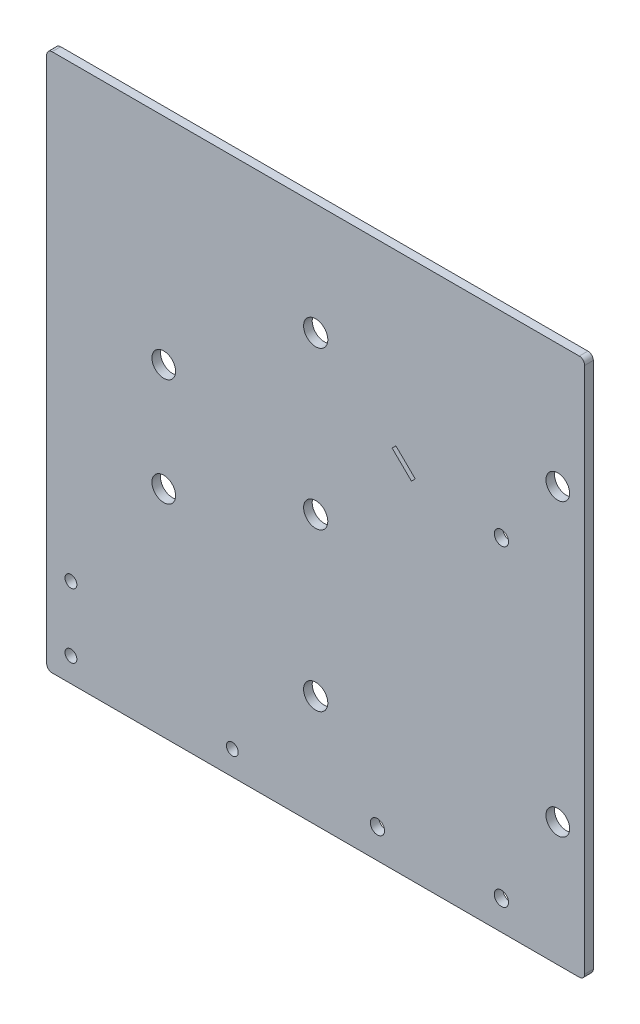
ISO-10303-21;
HEADER;
FILE_DESCRIPTION(('STEP AP214'),'2;1');
FILE_NAME('part.step','',(''),(''),'','','');
FILE_SCHEMA(('AUTOMOTIVE_DESIGN { 1 0 10303 214 1 1 1 1 }'));
ENDSEC;
DATA;
#1=APPLICATION_CONTEXT('core data for automotive mechanical design processes');
#2=APPLICATION_PROTOCOL_DEFINITION('international standard','automotive_design',2000,#1);
#3=PRODUCT_CONTEXT('',#1,'mechanical');
#4=PRODUCT('Part','Part','',(#3));
#5=PRODUCT_RELATED_PRODUCT_CATEGORY('part','',(#4));
#6=PRODUCT_DEFINITION_FORMATION('','',#4);
#7=PRODUCT_DEFINITION_CONTEXT('part definition',#1,'design');
#8=PRODUCT_DEFINITION('design','',#6,#7);
#9=PRODUCT_DEFINITION_SHAPE('','',#8);
#10=(LENGTH_UNIT() NAMED_UNIT(*) SI_UNIT(.MILLI.,.METRE.));
#11=(NAMED_UNIT(*) PLANE_ANGLE_UNIT() SI_UNIT($,.RADIAN.));
#12=(NAMED_UNIT(*) SI_UNIT($,.STERADIAN.) SOLID_ANGLE_UNIT());
#13=UNCERTAINTY_MEASURE_WITH_UNIT(LENGTH_MEASURE(1.E-05),#10,'distance_accuracy_value','');
#14=(GEOMETRIC_REPRESENTATION_CONTEXT(3) GLOBAL_UNCERTAINTY_ASSIGNED_CONTEXT((#13)) GLOBAL_UNIT_ASSIGNED_CONTEXT((#10,
#11,#12)) REPRESENTATION_CONTEXT('',''));
#15=CARTESIAN_POINT('',(0.,0.,0.));
#16=DIRECTION('',(0.,0.,1.));
#17=DIRECTION('',(1.,0.,0.));
#18=AXIS2_PLACEMENT_3D('',#15,#16,#17);
#19=CARTESIAN_POINT('',(0.,0.,1.6));
#20=DIRECTION('',(0.,0.,-1.));
#21=DIRECTION('',(-1.,0.,0.));
#22=AXIS2_PLACEMENT_3D('',#19,#20,#21);
#23=PLANE('',#22);
#24=DIRECTION('',(0.,-1.,0.));
#25=VECTOR('',#24,1.);
#26=CARTESIAN_POINT('',(-50.,-50.,1.6));
#27=LINE('',#26,#25);
#28=CARTESIAN_POINT('',(-50.,49.,1.6));
#29=VERTEX_POINT('',#28);
#30=CARTESIAN_POINT('',(-50.,-49.,1.6));
#31=VERTEX_POINT('',#30);
#32=EDGE_CURVE('E245',#29,#31,#27,.T.);
#33=ORIENTED_EDGE('',*,*,#32,.T.);
#34=CARTESIAN_POINT('',(-49.,-49.,1.6));
#35=DIRECTION('',(0.,0.,-1.));
#36=DIRECTION('',(-1.,0.,0.));
#37=AXIS2_PLACEMENT_3D('',#34,#35,#36);
#38=CIRCLE('',#37,1.);
#39=CARTESIAN_POINT('',(-49.,-50.,1.6));
#40=VERTEX_POINT('',#39);
#41=EDGE_CURVE('E285',#31,#40,#38,.F.);
#42=ORIENTED_EDGE('',*,*,#41,.T.);
#43=DIRECTION('',(1.,0.,0.));
#44=VECTOR('',#43,1.);
#45=CARTESIAN_POINT('',(-50.,-50.,1.6));
#46=LINE('',#45,#44);
#47=CARTESIAN_POINT('',(49.,-50.,1.6));
#48=VERTEX_POINT('',#47);
#49=EDGE_CURVE('E248',#40,#48,#46,.T.);
#50=ORIENTED_EDGE('',*,*,#49,.T.);
#51=CARTESIAN_POINT('',(49.,-49.,1.6));
#52=DIRECTION('',(0.,0.,-1.));
#53=DIRECTION('',(-1.,0.,0.));
#54=AXIS2_PLACEMENT_3D('',#51,#52,#53);
#55=CIRCLE('',#54,1.);
#56=CARTESIAN_POINT('',(50.,-49.,1.6));
#57=VERTEX_POINT('',#56);
#58=EDGE_CURVE('E281',#48,#57,#55,.F.);
#59=ORIENTED_EDGE('',*,*,#58,.T.);
#60=DIRECTION('',(0.,1.,0.));
#61=VECTOR('',#60,1.);
#62=CARTESIAN_POINT('',(50.,-50.,1.6));
#63=LINE('',#62,#61);
#64=CARTESIAN_POINT('',(50.,49.,1.6));
#65=VERTEX_POINT('',#64);
#66=EDGE_CURVE('E238',#57,#65,#63,.T.);
#67=ORIENTED_EDGE('',*,*,#66,.T.);
#68=CARTESIAN_POINT('',(49.,49.,1.6));
#69=DIRECTION('',(0.,0.,-1.));
#70=DIRECTION('',(-1.,0.,0.));
#71=AXIS2_PLACEMENT_3D('',#68,#69,#70);
#72=CIRCLE('',#71,1.);
#73=CARTESIAN_POINT('',(49.,50.,1.6));
#74=VERTEX_POINT('',#73);
#75=EDGE_CURVE('E279',#65,#74,#72,.F.);
#76=ORIENTED_EDGE('',*,*,#75,.T.);
#77=DIRECTION('',(-1.,0.,0.));
#78=VECTOR('',#77,1.);
#79=CARTESIAN_POINT('',(-50.,50.,1.6));
#80=LINE('',#79,#78);
#81=CARTESIAN_POINT('',(-49.,50.,1.6));
#82=VERTEX_POINT('',#81);
#83=EDGE_CURVE('E241',#74,#82,#80,.T.);
#84=ORIENTED_EDGE('',*,*,#83,.T.);
#85=CARTESIAN_POINT('',(-49.,49.,1.6));
#86=DIRECTION('',(0.,0.,-1.));
#87=DIRECTION('',(-1.,0.,0.));
#88=AXIS2_PLACEMENT_3D('',#85,#86,#87);
#89=CIRCLE('',#88,1.);
#90=EDGE_CURVE('E283',#82,#29,#89,.F.);
#91=ORIENTED_EDGE('',*,*,#90,.T.);
#92=EDGE_LOOP('',(#33,#42,#50,#59,#67,#76,#84,#91));
#93=FACE_BOUND('',#92,.T.);
#94=CARTESIAN_POINT('',(45.,27.,1.6));
#95=DIRECTION('',(0.,0.,1.));
#96=DIRECTION('',(1.,0.,0.));
#97=AXIS2_PLACEMENT_3D('',#94,#95,#96);
#98=CIRCLE('',#97,2.2);
#99=CARTESIAN_POINT('',(47.2,27.,1.6));
#100=VERTEX_POINT('',#99);
#101=EDGE_CURVE('E223',#100,#100,#98,.F.);
#102=ORIENTED_EDGE('',*,*,#101,.T.);
#103=EDGE_LOOP('',(#102));
#104=FACE_BOUND('',#103,.T.);
#105=CARTESIAN_POINT('',(0.,-29.25,1.6));
#106=DIRECTION('',(0.,0.,-1.));
#107=DIRECTION('',(-1.,0.,0.));
#108=AXIS2_PLACEMENT_3D('',#105,#106,#107);
#109=CIRCLE('',#108,2.25);
#110=CARTESIAN_POINT('',(-2.25,-29.25,1.6));
#111=VERTEX_POINT('',#110);
#112=EDGE_CURVE('E179',#111,#111,#109,.T.);
#113=ORIENTED_EDGE('',*,*,#112,.T.);
#114=EDGE_LOOP('',(#113));
#115=FACE_BOUND('',#114,.T.);
#116=CARTESIAN_POINT('',(0.,29.25,1.6));
#117=DIRECTION('',(0.,0.,-1.));
#118=DIRECTION('',(-1.,0.,0.));
#119=AXIS2_PLACEMENT_3D('',#116,#117,#118);
#120=CIRCLE('',#119,2.25);
#121=CARTESIAN_POINT('',(-2.25,29.25,1.6));
#122=VERTEX_POINT('',#121);
#123=EDGE_CURVE('E173',#122,#122,#120,.T.);
#124=ORIENTED_EDGE('',*,*,#123,.T.);
#125=EDGE_LOOP('',(#124));
#126=FACE_BOUND('',#125,.T.);
#127=CARTESIAN_POINT('',(-45.5,-45.5,1.6));
#128=DIRECTION('',(0.,0.,1.));
#129=DIRECTION('',(1.,0.,0.));
#130=AXIS2_PLACEMENT_3D('',#127,#128,#129);
#131=CIRCLE('',#130,1.10000000000002);
#132=CARTESIAN_POINT('',(-44.4,-45.5,1.6));
#133=VERTEX_POINT('',#132);
#134=EDGE_CURVE('E167',#133,#133,#131,.F.);
#135=ORIENTED_EDGE('',*,*,#134,.T.);
#136=EDGE_LOOP('',(#135));
#137=FACE_BOUND('',#136,.T.);
#138=CARTESIAN_POINT('',(-45.5,-33.5,1.6));
#139=DIRECTION('',(0.,0.,1.));
#140=DIRECTION('',(1.,0.,0.));
#141=AXIS2_PLACEMENT_3D('',#138,#139,#140);
#142=CIRCLE('',#141,1.10000000000002);
#143=CARTESIAN_POINT('',(-44.4,-33.5,1.6));
#144=VERTEX_POINT('',#143);
#145=EDGE_CURVE('E160',#144,#144,#142,.F.);
#146=ORIENTED_EDGE('',*,*,#145,.T.);
#147=EDGE_LOOP('',(#146));
#148=FACE_BOUND('',#147,.T.);
#149=CARTESIAN_POINT('',(34.525,-44.525,1.6));
#150=DIRECTION('',(0.,0.,1.));
#151=DIRECTION('',(1.,0.,0.));
#152=AXIS2_PLACEMENT_3D('',#149,#150,#151);
#153=CIRCLE('',#152,1.325);
#154=CARTESIAN_POINT('',(35.85,-44.525,1.6));
#155=VERTEX_POINT('',#154);
#156=EDGE_CURVE('E215',#155,#155,#153,.F.);
#157=ORIENTED_EDGE('',*,*,#156,.T.);
#158=EDGE_LOOP('',(#157));
#159=FACE_BOUND('',#158,.T.);
#160=CARTESIAN_POINT('',(34.525,13.525,1.6));
#161=DIRECTION('',(0.,0.,1.));
#162=DIRECTION('',(1.,0.,0.));
#163=AXIS2_PLACEMENT_3D('',#160,#161,#162);
#164=CIRCLE('',#163,1.325);
#165=CARTESIAN_POINT('',(35.85,13.525,1.6));
#166=VERTEX_POINT('',#165);
#167=EDGE_CURVE('E208',#166,#166,#164,.F.);
#168=ORIENTED_EDGE('',*,*,#167,.T.);
#169=EDGE_LOOP('',(#168));
#170=FACE_BOUND('',#169,.T.);
#171=CARTESIAN_POINT('',(0.,0.,1.6));
#172=DIRECTION('',(0.,0.,1.));
#173=DIRECTION('',(1.,0.,0.));
#174=AXIS2_PLACEMENT_3D('',#171,#172,#173);
#175=CIRCLE('',#174,2.24789999999998);
#176=CARTESIAN_POINT('',(2.24789999999998,0.,1.6));
#177=VERTEX_POINT('',#176);
#178=EDGE_CURVE('E227',#177,#177,#175,.F.);
#179=ORIENTED_EDGE('',*,*,#178,.T.);
#180=EDGE_LOOP('',(#179));
#181=FACE_BOUND('',#180,.T.);
#182=CARTESIAN_POINT('',(45.,-27.,1.6));
#183=DIRECTION('',(0.,0.,1.));
#184=DIRECTION('',(1.,0.,0.));
#185=AXIS2_PLACEMENT_3D('',#182,#183,#184);
#186=CIRCLE('',#185,2.2);
#187=CARTESIAN_POINT('',(47.2,-27.,1.6));
#188=VERTEX_POINT('',#187);
#189=EDGE_CURVE('E220',#188,#188,#186,.F.);
#190=ORIENTED_EDGE('',*,*,#189,.T.);
#191=EDGE_LOOP('',(#190));
#192=FACE_BOUND('',#191,.T.);
#193=CARTESIAN_POINT('',(-15.5,-45.5,1.6));
#194=DIRECTION('',(0.,0.,1.));
#195=DIRECTION('',(1.,0.,0.));
#196=AXIS2_PLACEMENT_3D('',#193,#194,#195);
#197=CIRCLE('',#196,1.10000000000001);
#198=CARTESIAN_POINT('',(-14.4,-45.5,1.6));
#199=VERTEX_POINT('',#198);
#200=EDGE_CURVE('E191',#199,#199,#197,.F.);
#201=ORIENTED_EDGE('',*,*,#200,.T.);
#202=EDGE_LOOP('',(#201));
#203=FACE_BOUND('',#202,.T.);
#204=CARTESIAN_POINT('',(-28.2446663784515,-9.99942988607603,1.6));
#205=DIRECTION('',(0.,0.,1.));
#206=DIRECTION('',(1.,0.,0.));
#207=AXIS2_PLACEMENT_3D('',#204,#205,#206);
#208=CIRCLE('',#207,2.20000000000001);
#209=CARTESIAN_POINT('',(-26.0446663784515,-9.99942988607603,1.6));
#210=VERTEX_POINT('',#209);
#211=EDGE_CURVE('E184',#210,#210,#208,.F.);
#212=ORIENTED_EDGE('',*,*,#211,.T.);
#213=EDGE_LOOP('',(#212));
#214=FACE_BOUND('',#213,.T.);
#215=CARTESIAN_POINT('',(-28.2446663784515,10.000570113924,1.6));
#216=DIRECTION('',(0.,0.,1.));
#217=DIRECTION('',(1.,0.,0.));
#218=AXIS2_PLACEMENT_3D('',#215,#216,#217);
#219=CIRCLE('',#218,2.2);
#220=CARTESIAN_POINT('',(-26.0446663784515,10.000570113924,1.6));
#221=VERTEX_POINT('',#220);
#222=EDGE_CURVE('E203',#221,#221,#219,.F.);
#223=ORIENTED_EDGE('',*,*,#222,.T.);
#224=EDGE_LOOP('',(#223));
#225=FACE_BOUND('',#224,.T.);
#226=CARTESIAN_POINT('',(11.475,-44.525,1.6));
#227=DIRECTION('',(0.,0.,1.));
#228=DIRECTION('',(1.,0.,0.));
#229=AXIS2_PLACEMENT_3D('',#226,#227,#228);
#230=CIRCLE('',#229,1.325);
#231=CARTESIAN_POINT('',(12.8,-44.525,1.6));
#232=VERTEX_POINT('',#231);
#233=EDGE_CURVE('E196',#232,#232,#230,.F.);
#234=ORIENTED_EDGE('',*,*,#233,.T.);
#235=EDGE_LOOP('',(#234));
#236=FACE_BOUND('',#235,.T.);
#237=DIRECTION('',(0.700361188976315,0.713788627659254,0.));
#238=VECTOR('',#237,1.);
#239=CARTESIAN_POINT('',(17.8049071948719,14.2657751738054,1.6));
#240=LINE('',#239,#238);
#241=CARTESIAN_POINT('',(17.8049071948719,14.2657751738054,1.6));
#242=VERTEX_POINT('',#241);
#243=CARTESIAN_POINT('',(18.5052683838482,14.9795638014646,1.6));
#244=VERTEX_POINT('',#243);
#245=EDGE_CURVE('E124',#242,#244,#240,.T.);
#246=ORIENTED_EDGE('',*,*,#245,.F.);
#247=DIRECTION('',(0.713788627659254,-0.700361188976316,0.));
#248=VECTOR('',#247,1.);
#249=CARTESIAN_POINT('',(14.2074630785591,17.7955459503993,1.6));
#250=LINE('',#249,#248);
#251=CARTESIAN_POINT('',(14.2074630785591,17.7955459503993,1.6));
#252=VERTEX_POINT('',#251);
#253=EDGE_CURVE('E146',#252,#242,#250,.T.);
#254=ORIENTED_EDGE('',*,*,#253,.F.);
#255=DIRECTION('',(-0.700361188976315,-0.713788627659255,0.));
#256=VECTOR('',#255,1.);
#257=CARTESIAN_POINT('',(14.9078242675354,18.5093345780585,1.6));
#258=LINE('',#257,#256);
#259=CARTESIAN_POINT('',(14.9078242675354,18.5093345780585,1.6));
#260=VERTEX_POINT('',#259);
#261=EDGE_CURVE('E144',#260,#252,#258,.T.);
#262=ORIENTED_EDGE('',*,*,#261,.F.);
#263=DIRECTION('',(-0.713788627659254,0.700361188976316,0.));
#264=VECTOR('',#263,1.);
#265=CARTESIAN_POINT('',(18.5052683838482,14.9795638014646,1.6));
#266=LINE('',#265,#264);
#267=EDGE_CURVE('E132',#244,#260,#266,.T.);
#268=ORIENTED_EDGE('',*,*,#267,.F.);
#269=EDGE_LOOP('',(#246,#254,#262,#268));
#270=FACE_BOUND('',#269,.T.);
#271=ADVANCED_FACE('F35',(#93,#104,#115,#126,#137,#148,#159,#170,#181,#192,#203,#214,#225,#236,
#270),#23,.F.);
#272=CARTESIAN_POINT('',(0.,0.,0.));
#273=DIRECTION('',(0.,0.,-1.));
#274=DIRECTION('',(-1.,0.,0.));
#275=AXIS2_PLACEMENT_3D('',#272,#273,#274);
#276=PLANE('',#275);
#277=CARTESIAN_POINT('',(11.475,-44.525,0.));
#278=DIRECTION('',(0.,0.,1.));
#279=DIRECTION('',(1.,0.,0.));
#280=AXIS2_PLACEMENT_3D('',#277,#278,#279);
#281=CIRCLE('',#280,1.325);
#282=CARTESIAN_POINT('',(12.8,-44.525,0.));
#283=VERTEX_POINT('',#282);
#284=EDGE_CURVE('E200',#283,#283,#281,.F.);
#285=ORIENTED_EDGE('',*,*,#284,.F.);
#286=EDGE_LOOP('',(#285));
#287=FACE_BOUND('',#286,.T.);
#288=CARTESIAN_POINT('',(-28.2446663784515,10.000570113924,0.));
#289=DIRECTION('',(0.,0.,1.));
#290=DIRECTION('',(1.,0.,0.));
#291=AXIS2_PLACEMENT_3D('',#288,#289,#290);
#292=CIRCLE('',#291,2.2);
#293=CARTESIAN_POINT('',(-26.0446663784515,10.000570113924,0.));
#294=VERTEX_POINT('',#293);
#295=EDGE_CURVE('E187',#294,#294,#292,.F.);
#296=ORIENTED_EDGE('',*,*,#295,.F.);
#297=EDGE_LOOP('',(#296));
#298=FACE_BOUND('',#297,.T.);
#299=CARTESIAN_POINT('',(-28.2446663784515,-9.99942988607603,0.));
#300=DIRECTION('',(0.,0.,1.));
#301=DIRECTION('',(1.,0.,0.));
#302=AXIS2_PLACEMENT_3D('',#299,#300,#301);
#303=CIRCLE('',#302,2.20000000000001);
#304=CARTESIAN_POINT('',(-26.0446663784515,-9.99942988607603,0.));
#305=VERTEX_POINT('',#304);
#306=EDGE_CURVE('E188',#305,#305,#303,.F.);
#307=ORIENTED_EDGE('',*,*,#306,.F.);
#308=EDGE_LOOP('',(#307));
#309=FACE_BOUND('',#308,.T.);
#310=CARTESIAN_POINT('',(-15.5,-45.5,0.));
#311=DIRECTION('',(0.,0.,1.));
#312=DIRECTION('',(1.,0.,0.));
#313=AXIS2_PLACEMENT_3D('',#310,#311,#312);
#314=CIRCLE('',#313,1.10000000000001);
#315=CARTESIAN_POINT('',(-14.4,-45.5,0.));
#316=VERTEX_POINT('',#315);
#317=EDGE_CURVE('E163',#316,#316,#314,.F.);
#318=ORIENTED_EDGE('',*,*,#317,.F.);
#319=EDGE_LOOP('',(#318));
#320=FACE_BOUND('',#319,.T.);
#321=CARTESIAN_POINT('',(45.,-27.,0.));
#322=DIRECTION('',(0.,0.,1.));
#323=DIRECTION('',(1.,0.,0.));
#324=AXIS2_PLACEMENT_3D('',#321,#322,#323);
#325=CIRCLE('',#324,2.2);
#326=CARTESIAN_POINT('',(47.2,-27.,0.));
#327=VERTEX_POINT('',#326);
#328=EDGE_CURVE('E224',#327,#327,#325,.F.);
#329=ORIENTED_EDGE('',*,*,#328,.F.);
#330=EDGE_LOOP('',(#329));
#331=FACE_BOUND('',#330,.T.);
#332=CARTESIAN_POINT('',(0.,0.,0.));
#333=DIRECTION('',(0.,0.,1.));
#334=DIRECTION('',(1.,0.,0.));
#335=AXIS2_PLACEMENT_3D('',#332,#333,#334);
#336=CIRCLE('',#335,2.24789999999998);
#337=CARTESIAN_POINT('',(2.24789999999998,0.,0.));
#338=VERTEX_POINT('',#337);
#339=EDGE_CURVE('E211',#338,#338,#336,.F.);
#340=ORIENTED_EDGE('',*,*,#339,.F.);
#341=EDGE_LOOP('',(#340));
#342=FACE_BOUND('',#341,.T.);
#343=CARTESIAN_POINT('',(34.525,13.525,0.));
#344=DIRECTION('',(0.,0.,1.));
#345=DIRECTION('',(1.,0.,0.));
#346=AXIS2_PLACEMENT_3D('',#343,#344,#345);
#347=CIRCLE('',#346,1.325);
#348=CARTESIAN_POINT('',(35.85,13.525,0.));
#349=VERTEX_POINT('',#348);
#350=EDGE_CURVE('E212',#349,#349,#347,.F.);
#351=ORIENTED_EDGE('',*,*,#350,.F.);
#352=EDGE_LOOP('',(#351));
#353=FACE_BOUND('',#352,.T.);
#354=CARTESIAN_POINT('',(34.525,-44.525,0.));
#355=DIRECTION('',(0.,0.,1.));
#356=DIRECTION('',(1.,0.,0.));
#357=AXIS2_PLACEMENT_3D('',#354,#355,#356);
#358=CIRCLE('',#357,1.325);
#359=CARTESIAN_POINT('',(35.85,-44.525,0.));
#360=VERTEX_POINT('',#359);
#361=EDGE_CURVE('E199',#360,#360,#358,.F.);
#362=ORIENTED_EDGE('',*,*,#361,.F.);
#363=EDGE_LOOP('',(#362));
#364=FACE_BOUND('',#363,.T.);
#365=CARTESIAN_POINT('',(-45.5,-33.5,0.));
#366=DIRECTION('',(0.,0.,1.));
#367=DIRECTION('',(1.,0.,0.));
#368=AXIS2_PLACEMENT_3D('',#365,#366,#367);
#369=CIRCLE('',#368,1.10000000000002);
#370=CARTESIAN_POINT('',(-44.4,-33.5,0.));
#371=VERTEX_POINT('',#370);
#372=EDGE_CURVE('E164',#371,#371,#369,.F.);
#373=ORIENTED_EDGE('',*,*,#372,.F.);
#374=EDGE_LOOP('',(#373));
#375=FACE_BOUND('',#374,.T.);
#376=CARTESIAN_POINT('',(-45.5,-45.5,0.));
#377=DIRECTION('',(0.,0.,1.));
#378=DIRECTION('',(1.,0.,0.));
#379=AXIS2_PLACEMENT_3D('',#376,#377,#378);
#380=CIRCLE('',#379,1.10000000000002);
#381=CARTESIAN_POINT('',(-44.4,-45.5,0.));
#382=VERTEX_POINT('',#381);
#383=EDGE_CURVE('E170',#382,#382,#380,.F.);
#384=ORIENTED_EDGE('',*,*,#383,.F.);
#385=EDGE_LOOP('',(#384));
#386=FACE_BOUND('',#385,.T.);
#387=CARTESIAN_POINT('',(0.,29.25,0.));
#388=DIRECTION('',(0.,0.,-1.));
#389=DIRECTION('',(-1.,0.,0.));
#390=AXIS2_PLACEMENT_3D('',#387,#388,#389);
#391=CIRCLE('',#390,2.25);
#392=CARTESIAN_POINT('',(-2.25,29.25,0.));
#393=VERTEX_POINT('',#392);
#394=EDGE_CURVE('E176',#393,#393,#391,.T.);
#395=ORIENTED_EDGE('',*,*,#394,.F.);
#396=EDGE_LOOP('',(#395));
#397=FACE_BOUND('',#396,.T.);
#398=CARTESIAN_POINT('',(0.,-29.25,0.));
#399=DIRECTION('',(0.,0.,-1.));
#400=DIRECTION('',(-1.,0.,0.));
#401=AXIS2_PLACEMENT_3D('',#398,#399,#400);
#402=CIRCLE('',#401,2.25);
#403=CARTESIAN_POINT('',(-2.25,-29.25,0.));
#404=VERTEX_POINT('',#403);
#405=EDGE_CURVE('E140',#404,#404,#402,.T.);
#406=ORIENTED_EDGE('',*,*,#405,.F.);
#407=EDGE_LOOP('',(#406));
#408=FACE_BOUND('',#407,.T.);
#409=CARTESIAN_POINT('',(45.,27.,0.));
#410=DIRECTION('',(0.,0.,1.));
#411=DIRECTION('',(1.,0.,0.));
#412=AXIS2_PLACEMENT_3D('',#409,#410,#411);
#413=CIRCLE('',#412,2.2);
#414=CARTESIAN_POINT('',(47.2,27.,0.));
#415=VERTEX_POINT('',#414);
#416=EDGE_CURVE('E232',#415,#415,#413,.F.);
#417=ORIENTED_EDGE('',*,*,#416,.F.);
#418=EDGE_LOOP('',(#417));
#419=FACE_BOUND('',#418,.T.);
#420=DIRECTION('',(1.,0.,0.));
#421=VECTOR('',#420,1.);
#422=CARTESIAN_POINT('',(-50.,-50.,0.));
#423=LINE('',#422,#421);
#424=CARTESIAN_POINT('',(-49.,-50.,0.));
#425=VERTEX_POINT('',#424);
#426=CARTESIAN_POINT('',(49.,-50.,0.));
#427=VERTEX_POINT('',#426);
#428=EDGE_CURVE('E242',#425,#427,#423,.T.);
#429=ORIENTED_EDGE('',*,*,#428,.F.);
#430=CARTESIAN_POINT('',(-49.,-49.,0.));
#431=DIRECTION('',(0.,0.,-1.));
#432=DIRECTION('',(-1.,0.,0.));
#433=AXIS2_PLACEMENT_3D('',#430,#431,#432);
#434=CIRCLE('',#433,1.);
#435=CARTESIAN_POINT('',(-50.,-49.,0.));
#436=VERTEX_POINT('',#435);
#437=EDGE_CURVE('E272',#425,#436,#434,.T.);
#438=ORIENTED_EDGE('',*,*,#437,.T.);
#439=DIRECTION('',(0.,-1.,0.));
#440=VECTOR('',#439,1.);
#441=CARTESIAN_POINT('',(-50.,-50.,0.));
#442=LINE('',#441,#440);
#443=CARTESIAN_POINT('',(-50.,49.,0.));
#444=VERTEX_POINT('',#443);
#445=EDGE_CURVE('E257',#444,#436,#442,.T.);
#446=ORIENTED_EDGE('',*,*,#445,.F.);
#447=CARTESIAN_POINT('',(-49.,49.,0.));
#448=DIRECTION('',(0.,0.,-1.));
#449=DIRECTION('',(-1.,0.,0.));
#450=AXIS2_PLACEMENT_3D('',#447,#448,#449);
#451=CIRCLE('',#450,1.);
#452=CARTESIAN_POINT('',(-49.,50.,0.));
#453=VERTEX_POINT('',#452);
#454=EDGE_CURVE('E270',#444,#453,#451,.T.);
#455=ORIENTED_EDGE('',*,*,#454,.T.);
#456=DIRECTION('',(-1.,0.,0.));
#457=VECTOR('',#456,1.);
#458=CARTESIAN_POINT('',(-50.,50.,0.));
#459=LINE('',#458,#457);
#460=CARTESIAN_POINT('',(49.,50.,0.));
#461=VERTEX_POINT('',#460);
#462=EDGE_CURVE('E254',#461,#453,#459,.T.);
#463=ORIENTED_EDGE('',*,*,#462,.F.);
#464=CARTESIAN_POINT('',(49.,49.,0.));
#465=DIRECTION('',(0.,0.,-1.));
#466=DIRECTION('',(-1.,0.,0.));
#467=AXIS2_PLACEMENT_3D('',#464,#465,#466);
#468=CIRCLE('',#467,1.);
#469=CARTESIAN_POINT('',(50.,49.,0.));
#470=VERTEX_POINT('',#469);
#471=EDGE_CURVE('E266',#461,#470,#468,.T.);
#472=ORIENTED_EDGE('',*,*,#471,.T.);
#473=DIRECTION('',(0.,1.,0.));
#474=VECTOR('',#473,1.);
#475=CARTESIAN_POINT('',(50.,-50.,0.));
#476=LINE('',#475,#474);
#477=CARTESIAN_POINT('',(50.,-49.,0.));
#478=VERTEX_POINT('',#477);
#479=EDGE_CURVE('E235',#478,#470,#476,.T.);
#480=ORIENTED_EDGE('',*,*,#479,.F.);
#481=CARTESIAN_POINT('',(49.,-49.,0.));
#482=DIRECTION('',(0.,0.,-1.));
#483=DIRECTION('',(-1.,0.,0.));
#484=AXIS2_PLACEMENT_3D('',#481,#482,#483);
#485=CIRCLE('',#484,1.);
#486=EDGE_CURVE('E268',#478,#427,#485,.T.);
#487=ORIENTED_EDGE('',*,*,#486,.T.);
#488=EDGE_LOOP('',(#429,#438,#446,#455,#463,#472,#480,#487));
#489=FACE_BOUND('',#488,.T.);
#490=DIRECTION('',(0.713788627659254,-0.700361188976316,0.));
#491=VECTOR('',#490,1.);
#492=CARTESIAN_POINT('',(14.2074630785591,17.7955459503993,0.));
#493=LINE('',#492,#491);
#494=CARTESIAN_POINT('',(14.2074630785591,17.7955459503993,0.));
#495=VERTEX_POINT('',#494);
#496=CARTESIAN_POINT('',(17.8049071948719,14.2657751738054,0.));
#497=VERTEX_POINT('',#496);
#498=EDGE_CURVE('E133',#495,#497,#493,.T.);
#499=ORIENTED_EDGE('',*,*,#498,.T.);
#500=DIRECTION('',(0.700361188976315,0.713788627659254,0.));
#501=VECTOR('',#500,1.);
#502=CARTESIAN_POINT('',(17.8049071948719,14.2657751738054,0.));
#503=LINE('',#502,#501);
#504=CARTESIAN_POINT('',(18.5052683838482,14.9795638014646,0.));
#505=VERTEX_POINT('',#504);
#506=EDGE_CURVE('E58',#497,#505,#503,.T.);
#507=ORIENTED_EDGE('',*,*,#506,.T.);
#508=DIRECTION('',(-0.713788627659254,0.700361188976316,0.));
#509=VECTOR('',#508,1.);
#510=CARTESIAN_POINT('',(18.5052683838482,14.9795638014646,0.));
#511=LINE('',#510,#509);
#512=CARTESIAN_POINT('',(14.9078242675354,18.5093345780585,0.));
#513=VERTEX_POINT('',#512);
#514=EDGE_CURVE('E139',#505,#513,#511,.T.);
#515=ORIENTED_EDGE('',*,*,#514,.T.);
#516=DIRECTION('',(-0.700361188976315,-0.713788627659255,0.));
#517=VECTOR('',#516,1.);
#518=CARTESIAN_POINT('',(14.9078242675354,18.5093345780585,0.));
#519=LINE('',#518,#517);
#520=EDGE_CURVE('E152',#513,#495,#519,.T.);
#521=ORIENTED_EDGE('',*,*,#520,.T.);
#522=EDGE_LOOP('',(#499,#507,#515,#521));
#523=FACE_BOUND('',#522,.T.);
#524=ADVANCED_FACE('F310',(#287,#298,#309,#320,#331,#342,#353,#364,#375,#386,#397,#408,#419,
#489,#523),#276,.T.);
#525=CARTESIAN_POINT('',(50.,-50.,1.6));
#526=DIRECTION('',(-1.,0.,0.));
#527=DIRECTION('',(0.,0.,1.));
#528=AXIS2_PLACEMENT_3D('',#525,#526,#527);
#529=PLANE('',#528);
#530=ORIENTED_EDGE('',*,*,#66,.F.);
#531=DIRECTION('',(0.,0.,-1.));
#532=VECTOR('',#531,1.);
#533=CARTESIAN_POINT('',(50.,-49.,1.6));
#534=LINE('',#533,#532);
#535=EDGE_CURVE('E11',#57,#478,#534,.T.);
#536=ORIENTED_EDGE('',*,*,#535,.T.);
#537=ORIENTED_EDGE('',*,*,#479,.T.);
#538=DIRECTION('',(0.,0.,-1.));
#539=VECTOR('',#538,1.);
#540=CARTESIAN_POINT('',(50.,49.,1.6));
#541=LINE('',#540,#539);
#542=EDGE_CURVE('E43',#470,#65,#541,.F.);
#543=ORIENTED_EDGE('',*,*,#542,.T.);
#544=EDGE_LOOP('',(#530,#536,#537,#543));
#545=FACE_BOUND('',#544,.T.);
#546=ADVANCED_FACE('F294',(#545),#529,.F.);
#547=CARTESIAN_POINT('',(-50.,50.,1.6));
#548=DIRECTION('',(0.,-1.,0.));
#549=DIRECTION('',(0.,0.,-1.));
#550=AXIS2_PLACEMENT_3D('',#547,#548,#549);
#551=PLANE('',#550);
#552=ORIENTED_EDGE('',*,*,#462,.T.);
#553=DIRECTION('',(0.,0.,-1.));
#554=VECTOR('',#553,1.);
#555=CARTESIAN_POINT('',(-49.,50.,1.6));
#556=LINE('',#555,#554);
#557=EDGE_CURVE('E290',#453,#82,#556,.F.);
#558=ORIENTED_EDGE('',*,*,#557,.T.);
#559=ORIENTED_EDGE('',*,*,#83,.F.);
#560=DIRECTION('',(0.,0.,-1.));
#561=VECTOR('',#560,1.);
#562=CARTESIAN_POINT('',(49.,50.,1.6));
#563=LINE('',#562,#561);
#564=EDGE_CURVE('E287',#74,#461,#563,.T.);
#565=ORIENTED_EDGE('',*,*,#564,.T.);
#566=EDGE_LOOP('',(#552,#558,#559,#565));
#567=FACE_BOUND('',#566,.T.);
#568=ADVANCED_FACE('F306',(#567),#551,.F.);
#569=CARTESIAN_POINT('',(-50.,-50.,1.6));
#570=DIRECTION('',(1.,0.,0.));
#571=DIRECTION('',(0.,0.,-1.));
#572=AXIS2_PLACEMENT_3D('',#569,#570,#571);
#573=PLANE('',#572);
#574=ORIENTED_EDGE('',*,*,#445,.T.);
#575=DIRECTION('',(0.,0.,-1.));
#576=VECTOR('',#575,1.);
#577=CARTESIAN_POINT('',(-50.,-49.,1.6));
#578=LINE('',#577,#576);
#579=EDGE_CURVE('E277',#436,#31,#578,.F.);
#580=ORIENTED_EDGE('',*,*,#579,.T.);
#581=ORIENTED_EDGE('',*,*,#32,.F.);
#582=DIRECTION('',(0.,0.,-1.));
#583=VECTOR('',#582,1.);
#584=CARTESIAN_POINT('',(-50.,49.,1.6));
#585=LINE('',#584,#583);
#586=EDGE_CURVE('E274',#29,#444,#585,.T.);
#587=ORIENTED_EDGE('',*,*,#586,.T.);
#588=EDGE_LOOP('',(#574,#580,#581,#587));
#589=FACE_BOUND('',#588,.T.);
#590=ADVANCED_FACE('F319',(#589),#573,.F.);
#591=CARTESIAN_POINT('',(-50.,-50.,1.6));
#592=DIRECTION('',(0.,1.,0.));
#593=DIRECTION('',(0.,0.,1.));
#594=AXIS2_PLACEMENT_3D('',#591,#592,#593);
#595=PLANE('',#594);
#596=ORIENTED_EDGE('',*,*,#49,.F.);
#597=DIRECTION('',(0.,0.,-1.));
#598=VECTOR('',#597,1.);
#599=CARTESIAN_POINT('',(-49.,-50.,1.6));
#600=LINE('',#599,#598);
#601=EDGE_CURVE('E263',#40,#425,#600,.T.);
#602=ORIENTED_EDGE('',*,*,#601,.T.);
#603=ORIENTED_EDGE('',*,*,#428,.T.);
#604=DIRECTION('',(0.,0.,-1.));
#605=VECTOR('',#604,1.);
#606=CARTESIAN_POINT('',(49.,-50.,1.6));
#607=LINE('',#606,#605);
#608=EDGE_CURVE('E251',#427,#48,#607,.F.);
#609=ORIENTED_EDGE('',*,*,#608,.T.);
#610=EDGE_LOOP('',(#596,#602,#603,#609));
#611=FACE_BOUND('',#610,.T.);
#612=ADVANCED_FACE('F327',(#611),#595,.F.);
#613=CARTESIAN_POINT('',(45.,27.,0.));
#614=DIRECTION('',(0.,0.,1.));
#615=DIRECTION('',(1.,0.,0.));
#616=AXIS2_PLACEMENT_3D('',#613,#614,#615);
#617=CYLINDRICAL_SURFACE('',#616,2.2);
#618=ORIENTED_EDGE('',*,*,#416,.T.);
#619=EDGE_LOOP('',(#618));
#620=FACE_BOUND('',#619,.T.);
#621=ORIENTED_EDGE('',*,*,#101,.F.);
#622=EDGE_LOOP('',(#621));
#623=FACE_BOUND('',#622,.T.);
#624=ADVANCED_FACE('F346',(#620,#623),#617,.F.);
#625=CARTESIAN_POINT('',(0.,-29.25,0.));
#626=DIRECTION('',(0.,0.,1.));
#627=DIRECTION('',(1.,0.,0.));
#628=AXIS2_PLACEMENT_3D('',#625,#626,#627);
#629=CYLINDRICAL_SURFACE('',#628,2.25);
#630=ORIENTED_EDGE('',*,*,#405,.T.);
#631=EDGE_LOOP('',(#630));
#632=FACE_BOUND('',#631,.T.);
#633=ORIENTED_EDGE('',*,*,#112,.F.);
#634=EDGE_LOOP('',(#633));
#635=FACE_BOUND('',#634,.T.);
#636=ADVANCED_FACE('F416',(#632,#635),#629,.F.);
#637=CARTESIAN_POINT('',(0.,29.25,0.));
#638=DIRECTION('',(0.,0.,1.));
#639=DIRECTION('',(1.,0.,0.));
#640=AXIS2_PLACEMENT_3D('',#637,#638,#639);
#641=CYLINDRICAL_SURFACE('',#640,2.25);
#642=ORIENTED_EDGE('',*,*,#394,.T.);
#643=EDGE_LOOP('',(#642));
#644=FACE_BOUND('',#643,.T.);
#645=ORIENTED_EDGE('',*,*,#123,.F.);
#646=EDGE_LOOP('',(#645));
#647=FACE_BOUND('',#646,.T.);
#648=ADVANCED_FACE('F419',(#644,#647),#641,.F.);
#649=CARTESIAN_POINT('',(-45.5,-45.5,0.));
#650=DIRECTION('',(0.,0.,1.));
#651=DIRECTION('',(1.,0.,0.));
#652=AXIS2_PLACEMENT_3D('',#649,#650,#651);
#653=CYLINDRICAL_SURFACE('',#652,1.10000000000002);
#654=ORIENTED_EDGE('',*,*,#383,.T.);
#655=EDGE_LOOP('',(#654));
#656=FACE_BOUND('',#655,.T.);
#657=ORIENTED_EDGE('',*,*,#134,.F.);
#658=EDGE_LOOP('',(#657));
#659=FACE_BOUND('',#658,.T.);
#660=ADVANCED_FACE('F423',(#656,#659),#653,.F.);
#661=CARTESIAN_POINT('',(-45.5,-33.5,0.));
#662=DIRECTION('',(0.,0.,1.));
#663=DIRECTION('',(1.,0.,0.));
#664=AXIS2_PLACEMENT_3D('',#661,#662,#663);
#665=CYLINDRICAL_SURFACE('',#664,1.10000000000002);
#666=ORIENTED_EDGE('',*,*,#372,.T.);
#667=EDGE_LOOP('',(#666));
#668=FACE_BOUND('',#667,.T.);
#669=ORIENTED_EDGE('',*,*,#145,.F.);
#670=EDGE_LOOP('',(#669));
#671=FACE_BOUND('',#670,.T.);
#672=ADVANCED_FACE('F384',(#668,#671),#665,.F.);
#673=CARTESIAN_POINT('',(34.525,-44.525,0.));
#674=DIRECTION('',(0.,0.,1.));
#675=DIRECTION('',(1.,0.,0.));
#676=AXIS2_PLACEMENT_3D('',#673,#674,#675);
#677=CYLINDRICAL_SURFACE('',#676,1.325);
#678=ORIENTED_EDGE('',*,*,#361,.T.);
#679=EDGE_LOOP('',(#678));
#680=FACE_BOUND('',#679,.T.);
#681=ORIENTED_EDGE('',*,*,#156,.F.);
#682=EDGE_LOOP('',(#681));
#683=FACE_BOUND('',#682,.T.);
#684=ADVANCED_FACE('F380',(#680,#683),#677,.F.);
#685=CARTESIAN_POINT('',(34.525,13.525,0.));
#686=DIRECTION('',(0.,0.,1.));
#687=DIRECTION('',(1.,0.,0.));
#688=AXIS2_PLACEMENT_3D('',#685,#686,#687);
#689=CYLINDRICAL_SURFACE('',#688,1.325);
#690=ORIENTED_EDGE('',*,*,#350,.T.);
#691=EDGE_LOOP('',(#690));
#692=FACE_BOUND('',#691,.T.);
#693=ORIENTED_EDGE('',*,*,#167,.F.);
#694=EDGE_LOOP('',(#693));
#695=FACE_BOUND('',#694,.T.);
#696=ADVANCED_FACE('F376',(#692,#695),#689,.F.);
#697=CARTESIAN_POINT('',(0.,0.,0.));
#698=DIRECTION('',(0.,0.,1.));
#699=DIRECTION('',(1.,0.,0.));
#700=AXIS2_PLACEMENT_3D('',#697,#698,#699);
#701=CYLINDRICAL_SURFACE('',#700,2.24789999999998);
#702=ORIENTED_EDGE('',*,*,#339,.T.);
#703=EDGE_LOOP('',(#702));
#704=FACE_BOUND('',#703,.T.);
#705=ORIENTED_EDGE('',*,*,#178,.F.);
#706=EDGE_LOOP('',(#705));
#707=FACE_BOUND('',#706,.T.);
#708=ADVANCED_FACE('F379',(#704,#707),#701,.F.);
#709=CARTESIAN_POINT('',(45.,-27.,0.));
#710=DIRECTION('',(0.,0.,1.));
#711=DIRECTION('',(1.,0.,0.));
#712=AXIS2_PLACEMENT_3D('',#709,#710,#711);
#713=CYLINDRICAL_SURFACE('',#712,2.2);
#714=ORIENTED_EDGE('',*,*,#328,.T.);
#715=EDGE_LOOP('',(#714));
#716=FACE_BOUND('',#715,.T.);
#717=ORIENTED_EDGE('',*,*,#189,.F.);
#718=EDGE_LOOP('',(#717));
#719=FACE_BOUND('',#718,.T.);
#720=ADVANCED_FACE('F386',(#716,#719),#713,.F.);
#721=CARTESIAN_POINT('',(-15.5,-45.5,0.));
#722=DIRECTION('',(0.,0.,1.));
#723=DIRECTION('',(1.,0.,0.));
#724=AXIS2_PLACEMENT_3D('',#721,#722,#723);
#725=CYLINDRICAL_SURFACE('',#724,1.10000000000001);
#726=ORIENTED_EDGE('',*,*,#317,.T.);
#727=EDGE_LOOP('',(#726));
#728=FACE_BOUND('',#727,.T.);
#729=ORIENTED_EDGE('',*,*,#200,.F.);
#730=EDGE_LOOP('',(#729));
#731=FACE_BOUND('',#730,.T.);
#732=ADVANCED_FACE('F373',(#728,#731),#725,.F.);
#733=CARTESIAN_POINT('',(-28.2446663784515,-9.99942988607603,0.));
#734=DIRECTION('',(0.,0.,1.));
#735=DIRECTION('',(1.,0.,0.));
#736=AXIS2_PLACEMENT_3D('',#733,#734,#735);
#737=CYLINDRICAL_SURFACE('',#736,2.20000000000001);
#738=ORIENTED_EDGE('',*,*,#306,.T.);
#739=EDGE_LOOP('',(#738));
#740=FACE_BOUND('',#739,.T.);
#741=ORIENTED_EDGE('',*,*,#211,.F.);
#742=EDGE_LOOP('',(#741));
#743=FACE_BOUND('',#742,.T.);
#744=ADVANCED_FACE('F368',(#740,#743),#737,.F.);
#745=CARTESIAN_POINT('',(-28.2446663784515,10.000570113924,0.));
#746=DIRECTION('',(0.,0.,1.));
#747=DIRECTION('',(1.,0.,0.));
#748=AXIS2_PLACEMENT_3D('',#745,#746,#747);
#749=CYLINDRICAL_SURFACE('',#748,2.2);
#750=ORIENTED_EDGE('',*,*,#295,.T.);
#751=EDGE_LOOP('',(#750));
#752=FACE_BOUND('',#751,.T.);
#753=ORIENTED_EDGE('',*,*,#222,.F.);
#754=EDGE_LOOP('',(#753));
#755=FACE_BOUND('',#754,.T.);
#756=ADVANCED_FACE('F362',(#752,#755),#749,.F.);
#757=CARTESIAN_POINT('',(11.475,-44.525,0.));
#758=DIRECTION('',(0.,0.,1.));
#759=DIRECTION('',(1.,0.,0.));
#760=AXIS2_PLACEMENT_3D('',#757,#758,#759);
#761=CYLINDRICAL_SURFACE('',#760,1.325);
#762=ORIENTED_EDGE('',*,*,#284,.T.);
#763=EDGE_LOOP('',(#762));
#764=FACE_BOUND('',#763,.T.);
#765=ORIENTED_EDGE('',*,*,#233,.F.);
#766=EDGE_LOOP('',(#765));
#767=FACE_BOUND('',#766,.T.);
#768=ADVANCED_FACE('F358',(#764,#767),#761,.F.);
#769=CARTESIAN_POINT('',(-49.,-49.,1.6));
#770=DIRECTION('',(0.,0.,-1.));
#771=DIRECTION('',(-1.,0.,0.));
#772=AXIS2_PLACEMENT_3D('',#769,#770,#771);
#773=CYLINDRICAL_SURFACE('',#772,1.);
#774=ORIENTED_EDGE('',*,*,#41,.F.);
#775=ORIENTED_EDGE('',*,*,#579,.F.);
#776=ORIENTED_EDGE('',*,*,#437,.F.);
#777=ORIENTED_EDGE('',*,*,#601,.F.);
#778=EDGE_LOOP('',(#774,#775,#776,#777));
#779=FACE_BOUND('',#778,.T.);
#780=ADVANCED_FACE('F325',(#779),#773,.T.);
#781=CARTESIAN_POINT('',(-49.,49.,1.6));
#782=DIRECTION('',(0.,0.,-1.));
#783=DIRECTION('',(-1.,0.,0.));
#784=AXIS2_PLACEMENT_3D('',#781,#782,#783);
#785=CYLINDRICAL_SURFACE('',#784,1.);
#786=ORIENTED_EDGE('',*,*,#90,.F.);
#787=ORIENTED_EDGE('',*,*,#557,.F.);
#788=ORIENTED_EDGE('',*,*,#454,.F.);
#789=ORIENTED_EDGE('',*,*,#586,.F.);
#790=EDGE_LOOP('',(#786,#787,#788,#789));
#791=FACE_BOUND('',#790,.T.);
#792=ADVANCED_FACE('F316',(#791),#785,.T.);
#793=CARTESIAN_POINT('',(49.,-49.,1.6));
#794=DIRECTION('',(0.,0.,-1.));
#795=DIRECTION('',(-1.,0.,0.));
#796=AXIS2_PLACEMENT_3D('',#793,#794,#795);
#797=CYLINDRICAL_SURFACE('',#796,1.);
#798=ORIENTED_EDGE('',*,*,#58,.F.);
#799=ORIENTED_EDGE('',*,*,#608,.F.);
#800=ORIENTED_EDGE('',*,*,#486,.F.);
#801=ORIENTED_EDGE('',*,*,#535,.F.);
#802=EDGE_LOOP('',(#798,#799,#800,#801));
#803=FACE_BOUND('',#802,.T.);
#804=ADVANCED_FACE('F330',(#803),#797,.T.);
#805=CARTESIAN_POINT('',(49.,49.,1.6));
#806=DIRECTION('',(0.,0.,-1.));
#807=DIRECTION('',(-1.,0.,0.));
#808=AXIS2_PLACEMENT_3D('',#805,#806,#807);
#809=CYLINDRICAL_SURFACE('',#808,1.);
#810=ORIENTED_EDGE('',*,*,#75,.F.);
#811=ORIENTED_EDGE('',*,*,#542,.F.);
#812=ORIENTED_EDGE('',*,*,#471,.F.);
#813=ORIENTED_EDGE('',*,*,#564,.F.);
#814=EDGE_LOOP('',(#810,#811,#812,#813));
#815=FACE_BOUND('',#814,.T.);
#816=ADVANCED_FACE('F37',(#815),#809,.T.);
#817=CARTESIAN_POINT('',(17.8049071948719,14.2657751738054,1.6));
#818=DIRECTION('',(-0.713788627659254,0.700361188976315,0.));
#819=DIRECTION('',(-0.700361188976315,-0.713788627659254,0.));
#820=AXIS2_PLACEMENT_3D('',#817,#818,#819);
#821=PLANE('',#820);
#822=ORIENTED_EDGE('',*,*,#506,.F.);
#823=DIRECTION('',(0.,0.,-1.));
#824=VECTOR('',#823,1.);
#825=CARTESIAN_POINT('',(17.8049071948719,14.2657751738054,1.6));
#826=LINE('',#825,#824);
#827=EDGE_CURVE('E128',#242,#497,#826,.T.);
#828=ORIENTED_EDGE('',*,*,#827,.F.);
#829=ORIENTED_EDGE('',*,*,#245,.T.);
#830=DIRECTION('',(0.,0.,-1.));
#831=VECTOR('',#830,1.);
#832=CARTESIAN_POINT('',(18.5052683838482,14.9795638014646,1.6));
#833=LINE('',#832,#831);
#834=EDGE_CURVE('E127',#244,#505,#833,.T.);
#835=ORIENTED_EDGE('',*,*,#834,.T.);
#836=EDGE_LOOP('',(#822,#828,#829,#835));
#837=FACE_BOUND('',#836,.T.);
#838=ADVANCED_FACE('F126',(#837),#821,.T.);
#839=CARTESIAN_POINT('',(18.5052683838482,14.9795638014646,1.6));
#840=DIRECTION('',(-0.700361188976316,-0.713788627659254,0.));
#841=DIRECTION('',(0.713788627659254,-0.700361188976316,0.));
#842=AXIS2_PLACEMENT_3D('',#839,#840,#841);
#843=PLANE('',#842);
#844=ORIENTED_EDGE('',*,*,#514,.F.);
#845=ORIENTED_EDGE('',*,*,#834,.F.);
#846=ORIENTED_EDGE('',*,*,#267,.T.);
#847=DIRECTION('',(0.,0.,-1.));
#848=VECTOR('',#847,1.);
#849=CARTESIAN_POINT('',(14.9078242675354,18.5093345780585,1.6));
#850=LINE('',#849,#848);
#851=EDGE_CURVE('E141',#260,#513,#850,.T.);
#852=ORIENTED_EDGE('',*,*,#851,.T.);
#853=EDGE_LOOP('',(#844,#845,#846,#852));
#854=FACE_BOUND('',#853,.T.);
#855=ADVANCED_FACE('F136',(#854),#843,.T.);
#856=CARTESIAN_POINT('',(14.9078242675354,18.5093345780585,1.6));
#857=DIRECTION('',(0.713788627659255,-0.700361188976315,0.));
#858=DIRECTION('',(0.700361188976315,0.713788627659255,0.));
#859=AXIS2_PLACEMENT_3D('',#856,#857,#858);
#860=PLANE('',#859);
#861=ORIENTED_EDGE('',*,*,#520,.F.);
#862=ORIENTED_EDGE('',*,*,#851,.F.);
#863=ORIENTED_EDGE('',*,*,#261,.T.);
#864=DIRECTION('',(0.,0.,-1.));
#865=VECTOR('',#864,1.);
#866=CARTESIAN_POINT('',(14.2074630785591,17.7955459503993,1.6));
#867=LINE('',#866,#865);
#868=EDGE_CURVE('E50',#252,#495,#867,.T.);
#869=ORIENTED_EDGE('',*,*,#868,.T.);
#870=EDGE_LOOP('',(#861,#862,#863,#869));
#871=FACE_BOUND('',#870,.T.);
#872=ADVANCED_FACE('F435',(#871),#860,.T.);
#873=CARTESIAN_POINT('',(14.2074630785591,17.7955459503993,1.6));
#874=DIRECTION('',(0.700361188976316,0.713788627659254,0.));
#875=DIRECTION('',(-0.713788627659254,0.700361188976316,0.));
#876=AXIS2_PLACEMENT_3D('',#873,#874,#875);
#877=PLANE('',#876);
#878=ORIENTED_EDGE('',*,*,#498,.F.);
#879=ORIENTED_EDGE('',*,*,#868,.F.);
#880=ORIENTED_EDGE('',*,*,#253,.T.);
#881=ORIENTED_EDGE('',*,*,#827,.T.);
#882=EDGE_LOOP('',(#878,#879,#880,#881));
#883=FACE_BOUND('',#882,.T.);
#884=ADVANCED_FACE('F438',(#883),#877,.T.);
#885=CLOSED_SHELL('',(#271,#524,#546,#568,#590,#612,#624,#636,#648,#660,#672,#684,#696,#708,
#720,#732,#744,#756,#768,#780,#792,#804,#816,#838,#855,#872,#884));
#886=MANIFOLD_SOLID_BREP('B2',#885);
#887=ADVANCED_BREP_SHAPE_REPRESENTATION('',(#18,#886),#14);
#888=SHAPE_DEFINITION_REPRESENTATION(#9,#887);
ENDSEC;
END-ISO-10303-21;
